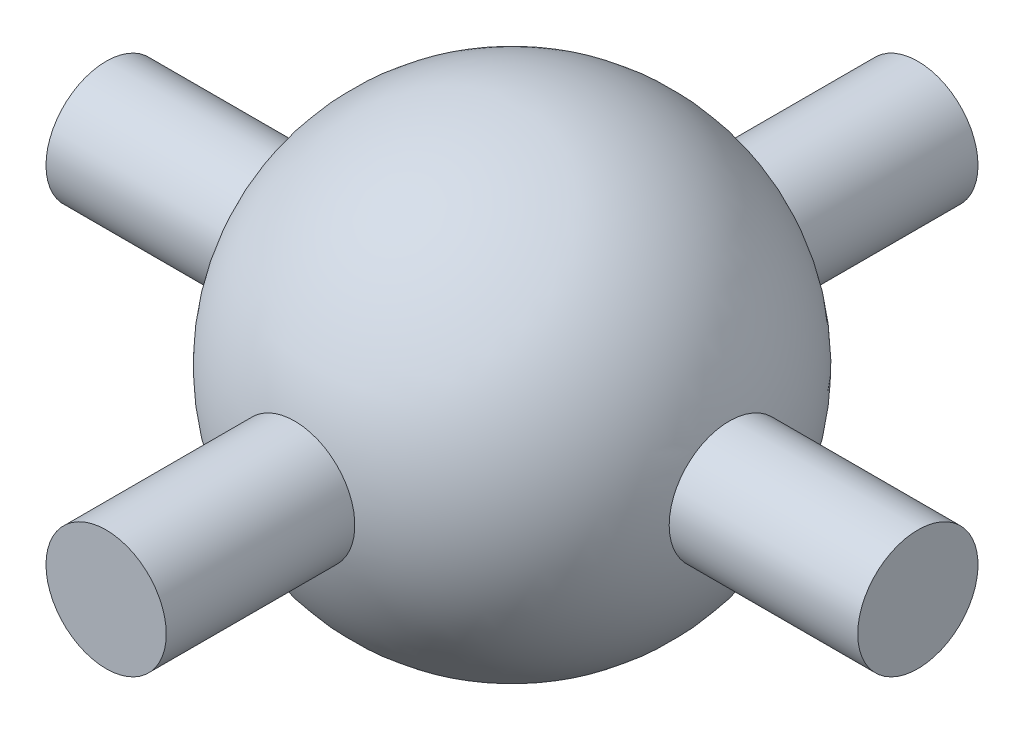
ISO-10303-21;
HEADER;
FILE_DESCRIPTION(('STEP AP214'),'2;1');
FILE_NAME('part.step','',(''),(''),'','','');
FILE_SCHEMA(('AUTOMOTIVE_DESIGN { 1 0 10303 214 1 1 1 1 }'));
ENDSEC;
DATA;
#1=APPLICATION_CONTEXT('core data for automotive mechanical design processes');
#2=APPLICATION_PROTOCOL_DEFINITION('international standard','automotive_design',2000,#1);
#3=PRODUCT_CONTEXT('',#1,'mechanical');
#4=PRODUCT('Part','Part','',(#3));
#5=PRODUCT_RELATED_PRODUCT_CATEGORY('part','',(#4));
#6=PRODUCT_DEFINITION_FORMATION('','',#4);
#7=PRODUCT_DEFINITION_CONTEXT('part definition',#1,'design');
#8=PRODUCT_DEFINITION('design','',#6,#7);
#9=PRODUCT_DEFINITION_SHAPE('','',#8);
#10=(LENGTH_UNIT() NAMED_UNIT(*) SI_UNIT(.MILLI.,.METRE.));
#11=(NAMED_UNIT(*) PLANE_ANGLE_UNIT() SI_UNIT($,.RADIAN.));
#12=(NAMED_UNIT(*) SI_UNIT($,.STERADIAN.) SOLID_ANGLE_UNIT());
#13=UNCERTAINTY_MEASURE_WITH_UNIT(LENGTH_MEASURE(1.E-05),#10,'distance_accuracy_value','');
#14=(GEOMETRIC_REPRESENTATION_CONTEXT(3) GLOBAL_UNCERTAINTY_ASSIGNED_CONTEXT((#13)) GLOBAL_UNIT_ASSIGNED_CONTEXT((#10,
#11,#12)) REPRESENTATION_CONTEXT('',''));
#15=CARTESIAN_POINT('',(0.,0.,0.));
#16=DIRECTION('',(0.,0.,1.));
#17=DIRECTION('',(1.,0.,0.));
#18=AXIS2_PLACEMENT_3D('',#15,#16,#17);
#19=CARTESIAN_POINT('',(0.,0.,0.));
#20=DIRECTION('',(0.,1.,0.));
#21=DIRECTION('',(1.,0.,0.));
#22=AXIS2_PLACEMENT_3D('',#19,#20,#21);
#23=SPHERICAL_SURFACE('',#22,3.75);
#24=CARTESIAN_POINT('',(0.,0.,3.61420807370024));
#25=DIRECTION('',(0.,0.,-1.));
#26=DIRECTION('',(-1.,0.,0.));
#27=AXIS2_PLACEMENT_3D('',#24,#25,#26);
#28=CIRCLE('',#27,1.);
#29=CARTESIAN_POINT('',(-1.,0.,3.61420807370024));
#30=VERTEX_POINT('',#29);
#31=EDGE_CURVE('E44',#30,#30,#28,.F.);
#32=ORIENTED_EDGE('',*,*,#31,.F.);
#33=EDGE_LOOP('',(#32));
#34=FACE_BOUND('',#33,.T.);
#35=CARTESIAN_POINT('',(0.,0.,-3.61420807370024));
#36=DIRECTION('',(0.,0.,1.));
#37=DIRECTION('',(1.,0.,0.));
#38=AXIS2_PLACEMENT_3D('',#35,#36,#37);
#39=CIRCLE('',#38,1.);
#40=CARTESIAN_POINT('',(1.,0.,-3.61420807370024));
#41=VERTEX_POINT('',#40);
#42=EDGE_CURVE('E40',#41,#41,#39,.F.);
#43=ORIENTED_EDGE('',*,*,#42,.F.);
#44=EDGE_LOOP('',(#43));
#45=FACE_BOUND('',#44,.T.);
#46=CARTESIAN_POINT('',(-3.61420807370024,0.,0.));
#47=DIRECTION('',(1.,0.,0.));
#48=DIRECTION('',(0.,0.,-1.));
#49=AXIS2_PLACEMENT_3D('',#46,#47,#48);
#50=CIRCLE('',#49,1.);
#51=CARTESIAN_POINT('',(-3.61420807370024,0.,-1.00000000000001));
#52=VERTEX_POINT('',#51);
#53=EDGE_CURVE('E36',#52,#52,#50,.F.);
#54=ORIENTED_EDGE('',*,*,#53,.F.);
#55=EDGE_LOOP('',(#54));
#56=FACE_BOUND('',#55,.T.);
#57=CARTESIAN_POINT('',(3.61420807370024,0.,0.));
#58=DIRECTION('',(-1.,0.,0.));
#59=DIRECTION('',(0.,0.,1.));
#60=AXIS2_PLACEMENT_3D('',#57,#58,#59);
#61=CIRCLE('',#60,1.);
#62=CARTESIAN_POINT('',(3.61420807370024,0.,1.00000000000001));
#63=VERTEX_POINT('',#62);
#64=EDGE_CURVE('E10',#63,#63,#61,.F.);
#65=ORIENTED_EDGE('',*,*,#64,.F.);
#66=EDGE_LOOP('',(#65));
#67=FACE_BOUND('',#66,.T.);
#68=ADVANCED_FACE('F30',(#34,#45,#56,#67),#23,.T.);
#69=CARTESIAN_POINT('',(0.,0.,6.75));
#70=DIRECTION('',(0.,0.,-1.));
#71=DIRECTION('',(-1.,0.,0.));
#72=AXIS2_PLACEMENT_3D('',#69,#70,#71);
#73=CYLINDRICAL_SURFACE('',#72,1.);
#74=CARTESIAN_POINT('',(0.,0.,-6.75));
#75=DIRECTION('',(0.,0.,1.));
#76=DIRECTION('',(1.,0.,0.));
#77=AXIS2_PLACEMENT_3D('',#74,#75,#76);
#78=CIRCLE('',#77,1.);
#79=CARTESIAN_POINT('',(1.,0.,-6.75));
#80=VERTEX_POINT('',#79);
#81=EDGE_CURVE('E50',#80,#80,#78,.T.);
#82=ORIENTED_EDGE('',*,*,#81,.T.);
#83=EDGE_LOOP('',(#82));
#84=FACE_BOUND('',#83,.T.);
#85=ORIENTED_EDGE('',*,*,#42,.T.);
#86=EDGE_LOOP('',(#85));
#87=FACE_BOUND('',#86,.T.);
#88=ADVANCED_FACE('F79',(#84,#87),#73,.T.);
#89=CARTESIAN_POINT('',(0.,0.,-6.75));
#90=DIRECTION('',(0.,0.,1.));
#91=DIRECTION('',(1.,0.,0.));
#92=AXIS2_PLACEMENT_3D('',#89,#90,#91);
#93=PLANE('',#92);
#94=ORIENTED_EDGE('',*,*,#81,.F.);
#95=EDGE_LOOP('',(#94));
#96=FACE_BOUND('',#95,.T.);
#97=ADVANCED_FACE('F84',(#96),#93,.F.);
#98=CARTESIAN_POINT('',(0.,0.,6.75));
#99=DIRECTION('',(0.,0.,1.));
#100=DIRECTION('',(1.,0.,0.));
#101=AXIS2_PLACEMENT_3D('',#98,#99,#100);
#102=PLANE('',#101);
#103=CARTESIAN_POINT('',(0.,0.,6.75));
#104=DIRECTION('',(0.,0.,1.));
#105=DIRECTION('',(1.,0.,0.));
#106=AXIS2_PLACEMENT_3D('',#103,#104,#105);
#107=CIRCLE('',#106,1.);
#108=CARTESIAN_POINT('',(1.,0.,6.75));
#109=VERTEX_POINT('',#108);
#110=EDGE_CURVE('E49',#109,#109,#107,.T.);
#111=ORIENTED_EDGE('',*,*,#110,.T.);
#112=EDGE_LOOP('',(#111));
#113=FACE_BOUND('',#112,.T.);
#114=ADVANCED_FACE('F94',(#113),#102,.T.);
#115=ORIENTED_EDGE('',*,*,#110,.F.);
#116=EDGE_LOOP('',(#115));
#117=FACE_BOUND('',#116,.T.);
#118=ORIENTED_EDGE('',*,*,#31,.T.);
#119=EDGE_LOOP('',(#118));
#120=FACE_BOUND('',#119,.T.);
#121=ADVANCED_FACE('F74',(#117,#120),#73,.T.);
#122=CARTESIAN_POINT('',(-6.75,0.,0.));
#123=DIRECTION('',(-1.,0.,0.));
#124=DIRECTION('',(0.,0.,1.));
#125=AXIS2_PLACEMENT_3D('',#122,#123,#124);
#126=PLANE('',#125);
#127=CARTESIAN_POINT('',(-6.75,0.,0.));
#128=DIRECTION('',(-1.,0.,0.));
#129=DIRECTION('',(0.,0.,1.));
#130=AXIS2_PLACEMENT_3D('',#127,#128,#129);
#131=CIRCLE('',#130,1.);
#132=CARTESIAN_POINT('',(-6.75,0.,0.999999999999976));
#133=VERTEX_POINT('',#132);
#134=EDGE_CURVE('E53',#133,#133,#131,.T.);
#135=ORIENTED_EDGE('',*,*,#134,.T.);
#136=EDGE_LOOP('',(#135));
#137=FACE_BOUND('',#136,.T.);
#138=ADVANCED_FACE('F62',(#137),#126,.T.);
#139=CARTESIAN_POINT('',(-6.75,0.,0.));
#140=DIRECTION('',(1.,0.,0.));
#141=DIRECTION('',(0.,0.,-1.));
#142=AXIS2_PLACEMENT_3D('',#139,#140,#141);
#143=CYLINDRICAL_SURFACE('',#142,1.);
#144=ORIENTED_EDGE('',*,*,#134,.F.);
#145=EDGE_LOOP('',(#144));
#146=FACE_BOUND('',#145,.T.);
#147=ORIENTED_EDGE('',*,*,#53,.T.);
#148=EDGE_LOOP('',(#147));
#149=FACE_BOUND('',#148,.T.);
#150=ADVANCED_FACE('F64',(#146,#149),#143,.T.);
#151=CARTESIAN_POINT('',(6.75,0.,0.));
#152=DIRECTION('',(-1.,0.,0.));
#153=DIRECTION('',(0.,0.,1.));
#154=AXIS2_PLACEMENT_3D('',#151,#152,#153);
#155=CIRCLE('',#154,1.);
#156=CARTESIAN_POINT('',(6.75,0.,1.00000000000002));
#157=VERTEX_POINT('',#156);
#158=EDGE_CURVE('E56',#157,#157,#155,.T.);
#159=ORIENTED_EDGE('',*,*,#158,.T.);
#160=EDGE_LOOP('',(#159));
#161=FACE_BOUND('',#160,.T.);
#162=ORIENTED_EDGE('',*,*,#64,.T.);
#163=EDGE_LOOP('',(#162));
#164=FACE_BOUND('',#163,.T.);
#165=ADVANCED_FACE('F66',(#161,#164),#143,.T.);
#166=CARTESIAN_POINT('',(6.75,0.,0.));
#167=DIRECTION('',(-1.,0.,0.));
#168=DIRECTION('',(0.,0.,1.));
#169=AXIS2_PLACEMENT_3D('',#166,#167,#168);
#170=PLANE('',#169);
#171=ORIENTED_EDGE('',*,*,#158,.F.);
#172=EDGE_LOOP('',(#171));
#173=FACE_BOUND('',#172,.T.);
#174=ADVANCED_FACE('F72',(#173),#170,.F.);
#175=CLOSED_SHELL('',(#68,#88,#97,#114,#121,#138,#150,#165,#174));
#176=MANIFOLD_SOLID_BREP('B2',#175);
#177=ADVANCED_BREP_SHAPE_REPRESENTATION('',(#18,#176),#14);
#178=SHAPE_DEFINITION_REPRESENTATION(#9,#177);
ENDSEC;
END-ISO-10303-21;
